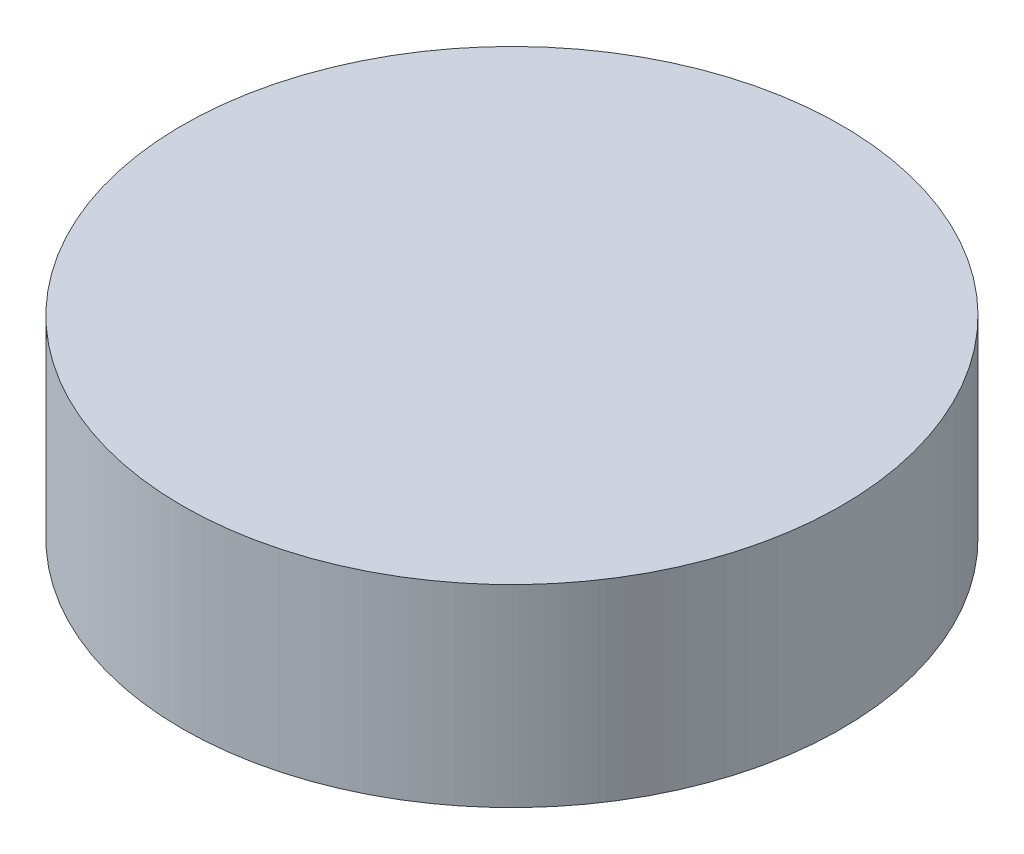
ISO-10303-21;
HEADER;
FILE_DESCRIPTION(('STEP AP214'),'2;1');
FILE_NAME('part.step','',(''),(''),'','','');
FILE_SCHEMA(('AUTOMOTIVE_DESIGN { 1 0 10303 214 1 1 1 1 }'));
ENDSEC;
DATA;
#1=APPLICATION_CONTEXT('core data for automotive mechanical design processes');
#2=APPLICATION_PROTOCOL_DEFINITION('international standard','automotive_design',2000,#1);
#3=PRODUCT_CONTEXT('',#1,'mechanical');
#4=PRODUCT('Part','Part','',(#3));
#5=PRODUCT_RELATED_PRODUCT_CATEGORY('part','',(#4));
#6=PRODUCT_DEFINITION_FORMATION('','',#4);
#7=PRODUCT_DEFINITION_CONTEXT('part definition',#1,'design');
#8=PRODUCT_DEFINITION('design','',#6,#7);
#9=PRODUCT_DEFINITION_SHAPE('','',#8);
#10=(LENGTH_UNIT() NAMED_UNIT(*) SI_UNIT(.MILLI.,.METRE.));
#11=(NAMED_UNIT(*) PLANE_ANGLE_UNIT() SI_UNIT($,.RADIAN.));
#12=(NAMED_UNIT(*) SI_UNIT($,.STERADIAN.) SOLID_ANGLE_UNIT());
#13=UNCERTAINTY_MEASURE_WITH_UNIT(LENGTH_MEASURE(1.E-05),#10,'distance_accuracy_value','');
#14=(GEOMETRIC_REPRESENTATION_CONTEXT(3) GLOBAL_UNCERTAINTY_ASSIGNED_CONTEXT((#13)) GLOBAL_UNIT_ASSIGNED_CONTEXT((#10,
#11,#12)) REPRESENTATION_CONTEXT('',''));
#15=CARTESIAN_POINT('',(0.,0.,0.));
#16=DIRECTION('',(0.,0.,1.));
#17=DIRECTION('',(1.,0.,0.));
#18=AXIS2_PLACEMENT_3D('',#15,#16,#17);
#19=CARTESIAN_POINT('',(0.,2.93,0.));
#20=DIRECTION('',(0.,-1.,0.));
#21=DIRECTION('',(0.,0.,-1.));
#22=AXIS2_PLACEMENT_3D('',#19,#20,#21);
#23=CYLINDRICAL_SURFACE('',#22,5.);
#24=CARTESIAN_POINT('',(0.,2.93,0.));
#25=DIRECTION('',(0.,1.,0.));
#26=DIRECTION('',(0.,0.,1.));
#27=AXIS2_PLACEMENT_3D('',#24,#25,#26);
#28=CIRCLE('',#27,5.);
#29=CARTESIAN_POINT('',(0.,2.93,5.));
#30=VERTEX_POINT('',#29);
#31=EDGE_CURVE('E10',#30,#30,#28,.T.);
#32=ORIENTED_EDGE('',*,*,#31,.F.);
#33=EDGE_LOOP('',(#32));
#34=FACE_BOUND('',#33,.T.);
#35=CARTESIAN_POINT('',(0.,0.,0.));
#36=DIRECTION('',(0.,1.,0.));
#37=DIRECTION('',(0.,0.,1.));
#38=AXIS2_PLACEMENT_3D('',#35,#36,#37);
#39=CIRCLE('',#38,5.);
#40=CARTESIAN_POINT('',(0.,0.,5.));
#41=VERTEX_POINT('',#40);
#42=EDGE_CURVE('E46',#41,#41,#39,.T.);
#43=ORIENTED_EDGE('',*,*,#42,.T.);
#44=EDGE_LOOP('',(#43));
#45=FACE_BOUND('',#44,.T.);
#46=ADVANCED_FACE('F43',(#34,#45),#23,.T.);
#47=CARTESIAN_POINT('',(0.,2.93,0.));
#48=DIRECTION('',(0.,1.,0.));
#49=DIRECTION('',(0.,0.,1.));
#50=AXIS2_PLACEMENT_3D('',#47,#48,#49);
#51=PLANE('',#50);
#52=ORIENTED_EDGE('',*,*,#31,.T.);
#53=EDGE_LOOP('',(#52));
#54=FACE_BOUND('',#53,.T.);
#55=ADVANCED_FACE('F60',(#54),#51,.T.);
#56=CARTESIAN_POINT('',(0.,0.,0.));
#57=DIRECTION('',(0.,1.,0.));
#58=DIRECTION('',(0.,0.,1.));
#59=AXIS2_PLACEMENT_3D('',#56,#57,#58);
#60=PLANE('',#59);
#61=ORIENTED_EDGE('',*,*,#42,.F.);
#62=EDGE_LOOP('',(#61));
#63=FACE_BOUND('',#62,.T.);
#64=ADVANCED_FACE('F58',(#63),#60,.F.);
#65=CLOSED_SHELL('',(#46,#55,#64));
#66=MANIFOLD_SOLID_BREP('B2',#65);
#67=ADVANCED_BREP_SHAPE_REPRESENTATION('',(#18,#66),#14);
#68=SHAPE_DEFINITION_REPRESENTATION(#9,#67);
ENDSEC;
END-ISO-10303-21;
